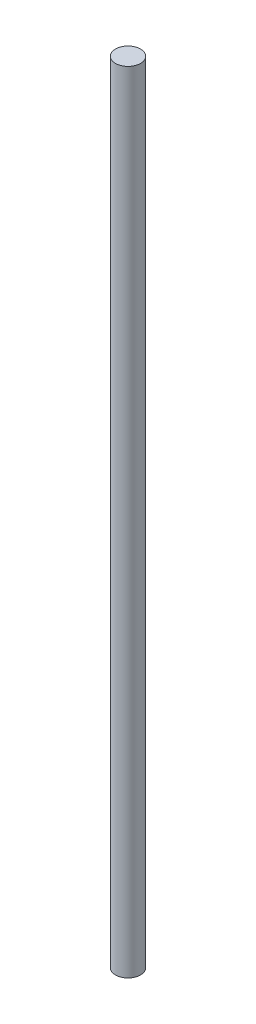
ISO-10303-21;
HEADER;
FILE_DESCRIPTION(('STEP AP214'),'2;1');
FILE_NAME('part.step','',(''),(''),'','','');
FILE_SCHEMA(('AUTOMOTIVE_DESIGN { 1 0 10303 214 1 1 1 1 }'));
ENDSEC;
DATA;
#1=APPLICATION_CONTEXT('core data for automotive mechanical design processes');
#2=APPLICATION_PROTOCOL_DEFINITION('international standard','automotive_design',2000,#1);
#3=PRODUCT_CONTEXT('',#1,'mechanical');
#4=PRODUCT('Part','Part','',(#3));
#5=PRODUCT_RELATED_PRODUCT_CATEGORY('part','',(#4));
#6=PRODUCT_DEFINITION_FORMATION('','',#4);
#7=PRODUCT_DEFINITION_CONTEXT('part definition',#1,'design');
#8=PRODUCT_DEFINITION('design','',#6,#7);
#9=PRODUCT_DEFINITION_SHAPE('','',#8);
#10=(LENGTH_UNIT() NAMED_UNIT(*) SI_UNIT(.MILLI.,.METRE.));
#11=(NAMED_UNIT(*) PLANE_ANGLE_UNIT() SI_UNIT($,.RADIAN.));
#12=(NAMED_UNIT(*) SI_UNIT($,.STERADIAN.) SOLID_ANGLE_UNIT());
#13=UNCERTAINTY_MEASURE_WITH_UNIT(LENGTH_MEASURE(1.E-05),#10,'distance_accuracy_value','');
#14=(GEOMETRIC_REPRESENTATION_CONTEXT(3) GLOBAL_UNCERTAINTY_ASSIGNED_CONTEXT((#13)) GLOBAL_UNIT_ASSIGNED_CONTEXT((#10,
#11,#12)) REPRESENTATION_CONTEXT('',''));
#15=CARTESIAN_POINT('',(0.,0.,0.));
#16=DIRECTION('',(0.,0.,1.));
#17=DIRECTION('',(1.,0.,0.));
#18=AXIS2_PLACEMENT_3D('',#15,#16,#17);
#19=CARTESIAN_POINT('',(0.,60.,0.));
#20=DIRECTION('',(0.,-1.,0.));
#21=DIRECTION('',(0.,0.,-1.));
#22=AXIS2_PLACEMENT_3D('',#19,#20,#21);
#23=CYLINDRICAL_SURFACE('',#22,0.95);
#24=CARTESIAN_POINT('',(0.,60.,0.));
#25=DIRECTION('',(0.,1.,0.));
#26=DIRECTION('',(0.,0.,1.));
#27=AXIS2_PLACEMENT_3D('',#24,#25,#26);
#28=CIRCLE('',#27,0.95);
#29=CARTESIAN_POINT('',(0.,60.,0.95));
#30=VERTEX_POINT('',#29);
#31=EDGE_CURVE('E10',#30,#30,#28,.T.);
#32=ORIENTED_EDGE('',*,*,#31,.F.);
#33=EDGE_LOOP('',(#32));
#34=FACE_BOUND('',#33,.T.);
#35=CARTESIAN_POINT('',(0.,0.,0.));
#36=DIRECTION('',(0.,1.,0.));
#37=DIRECTION('',(0.,0.,1.));
#38=AXIS2_PLACEMENT_3D('',#35,#36,#37);
#39=CIRCLE('',#38,0.95);
#40=CARTESIAN_POINT('',(0.,0.,0.95));
#41=VERTEX_POINT('',#40);
#42=EDGE_CURVE('E34',#41,#41,#39,.T.);
#43=ORIENTED_EDGE('',*,*,#42,.T.);
#44=EDGE_LOOP('',(#43));
#45=FACE_BOUND('',#44,.T.);
#46=ADVANCED_FACE('F31',(#34,#45),#23,.T.);
#47=CARTESIAN_POINT('',(0.,60.,0.));
#48=DIRECTION('',(0.,1.,0.));
#49=DIRECTION('',(0.,0.,1.));
#50=AXIS2_PLACEMENT_3D('',#47,#48,#49);
#51=PLANE('',#50);
#52=ORIENTED_EDGE('',*,*,#31,.T.);
#53=EDGE_LOOP('',(#52));
#54=FACE_BOUND('',#53,.T.);
#55=ADVANCED_FACE('F46',(#54),#51,.T.);
#56=CARTESIAN_POINT('',(0.,0.,0.));
#57=DIRECTION('',(0.,1.,0.));
#58=DIRECTION('',(0.,0.,1.));
#59=AXIS2_PLACEMENT_3D('',#56,#57,#58);
#60=PLANE('',#59);
#61=ORIENTED_EDGE('',*,*,#42,.F.);
#62=EDGE_LOOP('',(#61));
#63=FACE_BOUND('',#62,.T.);
#64=ADVANCED_FACE('F44',(#63),#60,.F.);
#65=CLOSED_SHELL('',(#46,#55,#64));
#66=MANIFOLD_SOLID_BREP('B2',#65);
#67=ADVANCED_BREP_SHAPE_REPRESENTATION('',(#18,#66),#14);
#68=SHAPE_DEFINITION_REPRESENTATION(#9,#67);
ENDSEC;
END-ISO-10303-21;
